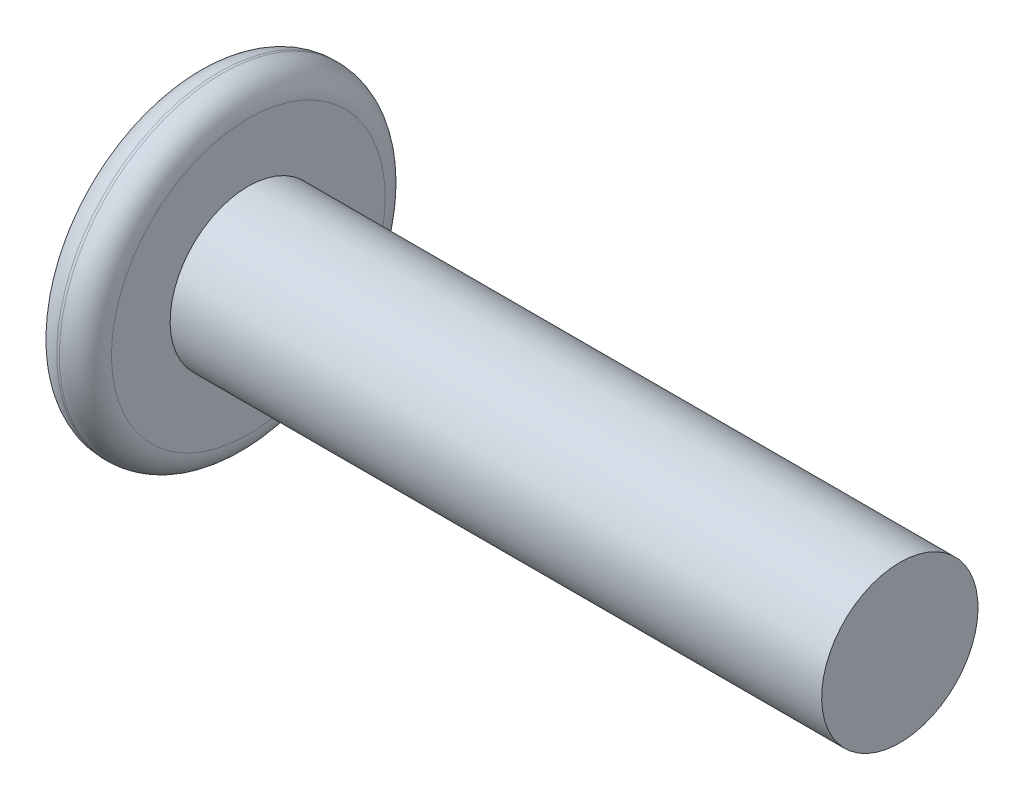
ISO-10303-21;
HEADER;
FILE_DESCRIPTION(('STEP AP214'),'2;1');
FILE_NAME('part.step','',(''),(''),'','','');
FILE_SCHEMA(('AUTOMOTIVE_DESIGN { 1 0 10303 214 1 1 1 1 }'));
ENDSEC;
DATA;
#1=APPLICATION_CONTEXT('core data for automotive mechanical design processes');
#2=APPLICATION_PROTOCOL_DEFINITION('international standard','automotive_design',2000,#1);
#3=PRODUCT_CONTEXT('',#1,'mechanical');
#4=PRODUCT('Part','Part','',(#3));
#5=PRODUCT_RELATED_PRODUCT_CATEGORY('part','',(#4));
#6=PRODUCT_DEFINITION_FORMATION('','',#4);
#7=PRODUCT_DEFINITION_CONTEXT('part definition',#1,'design');
#8=PRODUCT_DEFINITION('design','',#6,#7);
#9=PRODUCT_DEFINITION_SHAPE('','',#8);
#10=(LENGTH_UNIT() NAMED_UNIT(*) SI_UNIT(.MILLI.,.METRE.));
#11=(NAMED_UNIT(*) PLANE_ANGLE_UNIT() SI_UNIT($,.RADIAN.));
#12=(NAMED_UNIT(*) SI_UNIT($,.STERADIAN.) SOLID_ANGLE_UNIT());
#13=UNCERTAINTY_MEASURE_WITH_UNIT(LENGTH_MEASURE(1.E-05),#10,'distance_accuracy_value','');
#14=(GEOMETRIC_REPRESENTATION_CONTEXT(3) GLOBAL_UNCERTAINTY_ASSIGNED_CONTEXT((#13)) GLOBAL_UNIT_ASSIGNED_CONTEXT((#10,
#11,#12)) REPRESENTATION_CONTEXT('',''));
#15=CARTESIAN_POINT('',(0.,0.,0.));
#16=DIRECTION('',(0.,0.,1.));
#17=DIRECTION('',(1.,0.,0.));
#18=AXIS2_PLACEMENT_3D('',#15,#16,#17);
#19=CARTESIAN_POINT('',(0.,0.,0.));
#20=DIRECTION('',(-1.,0.,0.));
#21=DIRECTION('',(0.,-1.,0.));
#22=AXIS2_PLACEMENT_3D('',#19,#20,#21);
#23=PLANE('',#22);
#24=DIRECTION('',(0.,0.866025403784439,-0.5));
#25=VECTOR('',#24,1.);
#26=CARTESIAN_POINT('',(0.,0.,2.3094010767585));
#27=LINE('',#26,#25);
#28=CARTESIAN_POINT('',(0.,0.,2.3094010767585));
#29=VERTEX_POINT('',#28);
#30=CARTESIAN_POINT('',(0.,2.,1.15470053837925));
#31=VERTEX_POINT('',#30);
#32=EDGE_CURVE('E53',#29,#31,#27,.T.);
#33=ORIENTED_EDGE('',*,*,#32,.F.);
#34=DIRECTION('',(0.,0.866025403784439,0.5));
#35=VECTOR('',#34,1.);
#36=CARTESIAN_POINT('',(0.,-2.,1.15470053837925));
#37=LINE('',#36,#35);
#38=CARTESIAN_POINT('',(0.,-2.,1.15470053837925));
#39=VERTEX_POINT('',#38);
#40=EDGE_CURVE('E136',#39,#29,#37,.T.);
#41=ORIENTED_EDGE('',*,*,#40,.F.);
#42=DIRECTION('',(0.,0.,1.));
#43=VECTOR('',#42,1.);
#44=CARTESIAN_POINT('',(0.,-2.,-1.15470053837925));
#45=LINE('',#44,#43);
#46=CARTESIAN_POINT('',(0.,-2.,-1.15470053837925));
#47=VERTEX_POINT('',#46);
#48=EDGE_CURVE('E134',#47,#39,#45,.T.);
#49=ORIENTED_EDGE('',*,*,#48,.F.);
#50=DIRECTION('',(0.,-0.866025403784439,0.5));
#51=VECTOR('',#50,1.);
#52=CARTESIAN_POINT('',(0.,0.,-2.3094010767585));
#53=LINE('',#52,#51);
#54=CARTESIAN_POINT('',(0.,0.,-2.3094010767585));
#55=VERTEX_POINT('',#54);
#56=EDGE_CURVE('E101',#55,#47,#53,.T.);
#57=ORIENTED_EDGE('',*,*,#56,.F.);
#58=DIRECTION('',(0.,-0.866025403784438,-0.5));
#59=VECTOR('',#58,1.);
#60=CARTESIAN_POINT('',(0.,2.,-1.15470053837925));
#61=LINE('',#60,#59);
#62=CARTESIAN_POINT('',(0.,2.,-1.15470053837925));
#63=VERTEX_POINT('',#62);
#64=EDGE_CURVE('E130',#63,#55,#61,.T.);
#65=ORIENTED_EDGE('',*,*,#64,.F.);
#66=DIRECTION('',(0.,0.,-1.));
#67=VECTOR('',#66,1.);
#68=CARTESIAN_POINT('',(0.,2.,1.15470053837925));
#69=LINE('',#68,#67);
#70=EDGE_CURVE('E127',#31,#63,#69,.T.);
#71=ORIENTED_EDGE('',*,*,#70,.F.);
#72=EDGE_LOOP('',(#33,#41,#49,#57,#65,#71));
#73=FACE_BOUND('',#72,.T.);
#74=CARTESIAN_POINT('',(0.,0.,0.));
#75=DIRECTION('',(-1.,0.,0.));
#76=DIRECTION('',(0.,-1.,0.));
#77=AXIS2_PLACEMENT_3D('',#74,#75,#76);
#78=CIRCLE('',#77,5.25);
#79=CARTESIAN_POINT('',(0.,-5.25,0.));
#80=VERTEX_POINT('',#79);
#81=EDGE_CURVE('E11',#80,#80,#78,.T.);
#82=ORIENTED_EDGE('',*,*,#81,.T.);
#83=EDGE_LOOP('',(#82));
#84=FACE_BOUND('',#83,.T.);
#85=ADVANCED_FACE('F38',(#73,#84),#23,.T.);
#86=CARTESIAN_POINT('',(27.1,0.,0.));
#87=DIRECTION('',(1.,0.,0.));
#88=DIRECTION('',(0.,1.,0.));
#89=AXIS2_PLACEMENT_3D('',#86,#87,#88);
#90=CYLINDRICAL_SURFACE('',#89,6.25);
#91=CARTESIAN_POINT('',(1.1,0.,0.));
#92=DIRECTION('',(1.,0.,0.));
#93=DIRECTION('',(0.,1.,0.));
#94=AXIS2_PLACEMENT_3D('',#91,#92,#93);
#95=CIRCLE('',#94,6.25);
#96=CARTESIAN_POINT('',(1.1,6.25,0.));
#97=VERTEX_POINT('',#96);
#98=EDGE_CURVE('E46',#97,#97,#95,.F.);
#99=ORIENTED_EDGE('',*,*,#98,.T.);
#100=EDGE_LOOP('',(#99));
#101=FACE_BOUND('',#100,.T.);
#102=CARTESIAN_POINT('',(1.,0.,0.));
#103=DIRECTION('',(-1.,0.,0.));
#104=DIRECTION('',(0.,-1.,0.));
#105=AXIS2_PLACEMENT_3D('',#102,#103,#104);
#106=CIRCLE('',#105,6.25);
#107=CARTESIAN_POINT('',(1.,-6.25,0.));
#108=VERTEX_POINT('',#107);
#109=EDGE_CURVE('E154',#108,#108,#106,.F.);
#110=ORIENTED_EDGE('',*,*,#109,.T.);
#111=EDGE_LOOP('',(#110));
#112=FACE_BOUND('',#111,.T.);
#113=ADVANCED_FACE('F159',(#101,#112),#90,.T.);
#114=CARTESIAN_POINT('',(2.1,6.25,0.));
#115=DIRECTION('',(1.,0.,0.));
#116=DIRECTION('',(0.,1.,0.));
#117=AXIS2_PLACEMENT_3D('',#114,#115,#116);
#118=PLANE('',#117);
#119=CARTESIAN_POINT('',(2.1,0.,0.));
#120=DIRECTION('',(1.,0.,0.));
#121=DIRECTION('',(0.,1.,0.));
#122=AXIS2_PLACEMENT_3D('',#119,#120,#121);
#123=CIRCLE('',#122,5.25);
#124=CARTESIAN_POINT('',(2.1,5.25,0.));
#125=VERTEX_POINT('',#124);
#126=EDGE_CURVE('E151',#125,#125,#123,.T.);
#127=ORIENTED_EDGE('',*,*,#126,.T.);
#128=EDGE_LOOP('',(#127));
#129=FACE_BOUND('',#128,.T.);
#130=CARTESIAN_POINT('',(2.1,0.,0.));
#131=DIRECTION('',(1.,0.,0.));
#132=DIRECTION('',(0.,1.,0.));
#133=AXIS2_PLACEMENT_3D('',#130,#131,#132);
#134=CIRCLE('',#133,3.);
#135=CARTESIAN_POINT('',(2.1,3.,0.));
#136=VERTEX_POINT('',#135);
#137=EDGE_CURVE('E148',#136,#136,#134,.T.);
#138=ORIENTED_EDGE('',*,*,#137,.F.);
#139=EDGE_LOOP('',(#138));
#140=FACE_BOUND('',#139,.T.);
#141=ADVANCED_FACE('F168',(#129,#140),#118,.T.);
#142=CARTESIAN_POINT('',(27.1,0.,0.));
#143=DIRECTION('',(1.,0.,0.));
#144=DIRECTION('',(0.,1.,0.));
#145=AXIS2_PLACEMENT_3D('',#142,#143,#144);
#146=CYLINDRICAL_SURFACE('',#145,3.);
#147=ORIENTED_EDGE('',*,*,#137,.T.);
#148=EDGE_LOOP('',(#147));
#149=FACE_BOUND('',#148,.T.);
#150=CARTESIAN_POINT('',(27.1,0.,0.));
#151=DIRECTION('',(1.,0.,0.));
#152=DIRECTION('',(0.,1.,0.));
#153=AXIS2_PLACEMENT_3D('',#150,#151,#152);
#154=CIRCLE('',#153,3.);
#155=CARTESIAN_POINT('',(27.1,3.,0.));
#156=VERTEX_POINT('',#155);
#157=EDGE_CURVE('E140',#156,#156,#154,.T.);
#158=ORIENTED_EDGE('',*,*,#157,.F.);
#159=EDGE_LOOP('',(#158));
#160=FACE_BOUND('',#159,.T.);
#161=ADVANCED_FACE('F171',(#149,#160),#146,.T.);
#162=CARTESIAN_POINT('',(27.1,3.,0.));
#163=DIRECTION('',(1.,0.,0.));
#164=DIRECTION('',(0.,1.,0.));
#165=AXIS2_PLACEMENT_3D('',#162,#163,#164);
#166=PLANE('',#165);
#167=ORIENTED_EDGE('',*,*,#157,.T.);
#168=EDGE_LOOP('',(#167));
#169=FACE_BOUND('',#168,.T.);
#170=ADVANCED_FACE('F165',(#169),#166,.T.);
#171=CARTESIAN_POINT('',(1.1,0.,0.));
#172=DIRECTION('',(1.,0.,0.));
#173=DIRECTION('',(0.,1.,0.));
#174=AXIS2_PLACEMENT_3D('',#171,#172,#173);
#175=TOROIDAL_SURFACE('',#174,5.25,1.);
#176=ORIENTED_EDGE('',*,*,#98,.F.);
#177=EDGE_LOOP('',(#176));
#178=FACE_BOUND('',#177,.T.);
#179=ORIENTED_EDGE('',*,*,#126,.F.);
#180=EDGE_LOOP('',(#179));
#181=FACE_BOUND('',#180,.T.);
#182=ADVANCED_FACE('F162',(#178,#181),#175,.T.);
#183=CARTESIAN_POINT('',(1.,0.,0.));
#184=DIRECTION('',(-1.,0.,0.));
#185=DIRECTION('',(0.,-1.,0.));
#186=AXIS2_PLACEMENT_3D('',#183,#184,#185);
#187=TOROIDAL_SURFACE('',#186,5.25,1.);
#188=ORIENTED_EDGE('',*,*,#81,.F.);
#189=EDGE_LOOP('',(#188));
#190=FACE_BOUND('',#189,.T.);
#191=ORIENTED_EDGE('',*,*,#109,.F.);
#192=EDGE_LOOP('',(#191));
#193=FACE_BOUND('',#192,.T.);
#194=ADVANCED_FACE('F40',(#190,#193),#187,.T.);
#195=CARTESIAN_POINT('',(1.,0.,2.3094010767585));
#196=DIRECTION('',(0.,0.5,0.866025403784439));
#197=DIRECTION('',(0.,-0.866025403784439,0.5));
#198=AXIS2_PLACEMENT_3D('',#195,#196,#197);
#199=PLANE('',#198);
#200=ORIENTED_EDGE('',*,*,#32,.T.);
#201=DIRECTION('',(-1.,0.,0.));
#202=VECTOR('',#201,1.);
#203=CARTESIAN_POINT('',(1.,2.,1.15470053837925));
#204=LINE('',#203,#202);
#205=CARTESIAN_POINT('',(1.,2.,1.15470053837925));
#206=VERTEX_POINT('',#205);
#207=EDGE_CURVE('E83',#206,#31,#204,.T.);
#208=ORIENTED_EDGE('',*,*,#207,.F.);
#209=DIRECTION('',(0.,0.866025403784439,-0.5));
#210=VECTOR('',#209,1.);
#211=CARTESIAN_POINT('',(1.,0.,2.3094010767585));
#212=LINE('',#211,#210);
#213=CARTESIAN_POINT('',(1.,0.,2.3094010767585));
#214=VERTEX_POINT('',#213);
#215=EDGE_CURVE('E138',#214,#206,#212,.T.);
#216=ORIENTED_EDGE('',*,*,#215,.F.);
#217=DIRECTION('',(-1.,0.,0.));
#218=VECTOR('',#217,1.);
#219=CARTESIAN_POINT('',(1.,0.,2.3094010767585));
#220=LINE('',#219,#218);
#221=EDGE_CURVE('E61',#214,#29,#220,.T.);
#222=ORIENTED_EDGE('',*,*,#221,.T.);
#223=EDGE_LOOP('',(#200,#208,#216,#222));
#224=FACE_BOUND('',#223,.T.);
#225=ADVANCED_FACE('F199',(#224),#199,.F.);
#226=CARTESIAN_POINT('',(1.,-2.,1.15470053837925));
#227=DIRECTION('',(0.,-0.5,0.866025403784439));
#228=DIRECTION('',(0.,-0.866025403784439,-0.5));
#229=AXIS2_PLACEMENT_3D('',#226,#227,#228);
#230=PLANE('',#229);
#231=ORIENTED_EDGE('',*,*,#40,.T.);
#232=ORIENTED_EDGE('',*,*,#221,.F.);
#233=DIRECTION('',(0.,0.866025403784439,0.5));
#234=VECTOR('',#233,1.);
#235=CARTESIAN_POINT('',(1.,-2.,1.15470053837925));
#236=LINE('',#235,#234);
#237=CARTESIAN_POINT('',(1.,-2.,1.15470053837925));
#238=VERTEX_POINT('',#237);
#239=EDGE_CURVE('E113',#238,#214,#236,.T.);
#240=ORIENTED_EDGE('',*,*,#239,.F.);
#241=DIRECTION('',(-1.,0.,0.));
#242=VECTOR('',#241,1.);
#243=CARTESIAN_POINT('',(1.,-2.,1.15470053837925));
#244=LINE('',#243,#242);
#245=EDGE_CURVE('E105',#238,#39,#244,.T.);
#246=ORIENTED_EDGE('',*,*,#245,.T.);
#247=EDGE_LOOP('',(#231,#232,#240,#246));
#248=FACE_BOUND('',#247,.T.);
#249=ADVANCED_FACE('F204',(#248),#230,.F.);
#250=CARTESIAN_POINT('',(1.,-2.,-1.15470053837925));
#251=DIRECTION('',(0.,-1.,0.));
#252=DIRECTION('',(1.,0.,0.));
#253=AXIS2_PLACEMENT_3D('',#250,#251,#252);
#254=PLANE('',#253);
#255=ORIENTED_EDGE('',*,*,#48,.T.);
#256=ORIENTED_EDGE('',*,*,#245,.F.);
#257=DIRECTION('',(0.,0.,1.));
#258=VECTOR('',#257,1.);
#259=CARTESIAN_POINT('',(1.,-2.,-1.15470053837925));
#260=LINE('',#259,#258);
#261=CARTESIAN_POINT('',(1.,-2.,-1.15470053837925));
#262=VERTEX_POINT('',#261);
#263=EDGE_CURVE('E109',#262,#238,#260,.T.);
#264=ORIENTED_EDGE('',*,*,#263,.F.);
#265=DIRECTION('',(-1.,0.,0.));
#266=VECTOR('',#265,1.);
#267=CARTESIAN_POINT('',(1.,-2.,-1.15470053837925));
#268=LINE('',#267,#266);
#269=EDGE_CURVE('E94',#262,#47,#268,.T.);
#270=ORIENTED_EDGE('',*,*,#269,.T.);
#271=EDGE_LOOP('',(#255,#256,#264,#270));
#272=FACE_BOUND('',#271,.T.);
#273=ADVANCED_FACE('F110',(#272),#254,.F.);
#274=CARTESIAN_POINT('',(1.,0.,-2.3094010767585));
#275=DIRECTION('',(0.,-0.5,-0.866025403784439));
#276=DIRECTION('',(0.,0.866025403784439,-0.5));
#277=AXIS2_PLACEMENT_3D('',#274,#275,#276);
#278=PLANE('',#277);
#279=ORIENTED_EDGE('',*,*,#56,.T.);
#280=ORIENTED_EDGE('',*,*,#269,.F.);
#281=DIRECTION('',(0.,-0.866025403784439,0.5));
#282=VECTOR('',#281,1.);
#283=CARTESIAN_POINT('',(1.,0.,-2.3094010767585));
#284=LINE('',#283,#282);
#285=CARTESIAN_POINT('',(1.,0.,-2.3094010767585));
#286=VERTEX_POINT('',#285);
#287=EDGE_CURVE('E98',#286,#262,#284,.T.);
#288=ORIENTED_EDGE('',*,*,#287,.F.);
#289=DIRECTION('',(-1.,0.,0.));
#290=VECTOR('',#289,1.);
#291=CARTESIAN_POINT('',(1.,0.,-2.3094010767585));
#292=LINE('',#291,#290);
#293=EDGE_CURVE('E106',#286,#55,#292,.T.);
#294=ORIENTED_EDGE('',*,*,#293,.T.);
#295=EDGE_LOOP('',(#279,#280,#288,#294));
#296=FACE_BOUND('',#295,.T.);
#297=ADVANCED_FACE('F96',(#296),#278,.F.);
#298=CARTESIAN_POINT('',(1.,2.,-1.15470053837925));
#299=DIRECTION('',(0.,0.5,-0.866025403784439));
#300=DIRECTION('',(0.,0.866025403784438,0.5));
#301=AXIS2_PLACEMENT_3D('',#298,#299,#300);
#302=PLANE('',#301);
#303=ORIENTED_EDGE('',*,*,#64,.T.);
#304=ORIENTED_EDGE('',*,*,#293,.F.);
#305=DIRECTION('',(0.,-0.866025403784438,-0.5));
#306=VECTOR('',#305,1.);
#307=CARTESIAN_POINT('',(1.,2.,-1.15470053837925));
#308=LINE('',#307,#306);
#309=CARTESIAN_POINT('',(1.,2.,-1.15470053837925));
#310=VERTEX_POINT('',#309);
#311=EDGE_CURVE('E119',#310,#286,#308,.T.);
#312=ORIENTED_EDGE('',*,*,#311,.F.);
#313=DIRECTION('',(-1.,0.,0.));
#314=VECTOR('',#313,1.);
#315=CARTESIAN_POINT('',(1.,2.,-1.15470053837925));
#316=LINE('',#315,#314);
#317=EDGE_CURVE('E143',#310,#63,#316,.T.);
#318=ORIENTED_EDGE('',*,*,#317,.T.);
#319=EDGE_LOOP('',(#303,#304,#312,#318));
#320=FACE_BOUND('',#319,.T.);
#321=ADVANCED_FACE('F213',(#320),#302,.F.);
#322=CARTESIAN_POINT('',(1.,2.,1.15470053837925));
#323=DIRECTION('',(0.,1.,0.));
#324=DIRECTION('',(0.,0.,1.));
#325=AXIS2_PLACEMENT_3D('',#322,#323,#324);
#326=PLANE('',#325);
#327=ORIENTED_EDGE('',*,*,#70,.T.);
#328=ORIENTED_EDGE('',*,*,#317,.F.);
#329=DIRECTION('',(0.,0.,-1.));
#330=VECTOR('',#329,1.);
#331=CARTESIAN_POINT('',(1.,2.,1.15470053837925));
#332=LINE('',#331,#330);
#333=EDGE_CURVE('E121',#206,#310,#332,.T.);
#334=ORIENTED_EDGE('',*,*,#333,.F.);
#335=ORIENTED_EDGE('',*,*,#207,.T.);
#336=EDGE_LOOP('',(#327,#328,#334,#335));
#337=FACE_BOUND('',#336,.T.);
#338=ADVANCED_FACE('F210',(#337),#326,.F.);
#339=CARTESIAN_POINT('',(1.,0.,0.));
#340=DIRECTION('',(-1.,0.,0.));
#341=DIRECTION('',(0.,-1.,0.));
#342=AXIS2_PLACEMENT_3D('',#339,#340,#341);
#343=PLANE('',#342);
#344=ORIENTED_EDGE('',*,*,#215,.T.);
#345=ORIENTED_EDGE('',*,*,#333,.T.);
#346=ORIENTED_EDGE('',*,*,#311,.T.);
#347=ORIENTED_EDGE('',*,*,#287,.T.);
#348=ORIENTED_EDGE('',*,*,#263,.T.);
#349=ORIENTED_EDGE('',*,*,#239,.T.);
#350=EDGE_LOOP('',(#344,#345,#346,#347,#348,#349));
#351=FACE_BOUND('',#350,.T.);
#352=ADVANCED_FACE('F116',(#351),#343,.T.);
#353=CLOSED_SHELL('',(#85,#113,#141,#161,#170,#182,#194,#225,#249,#273,#297,#321,#338,#352));
#354=MANIFOLD_SOLID_BREP('B2',#353);
#355=ADVANCED_BREP_SHAPE_REPRESENTATION('',(#18,#354),#14);
#356=SHAPE_DEFINITION_REPRESENTATION(#9,#355);
ENDSEC;
END-ISO-10303-21;
